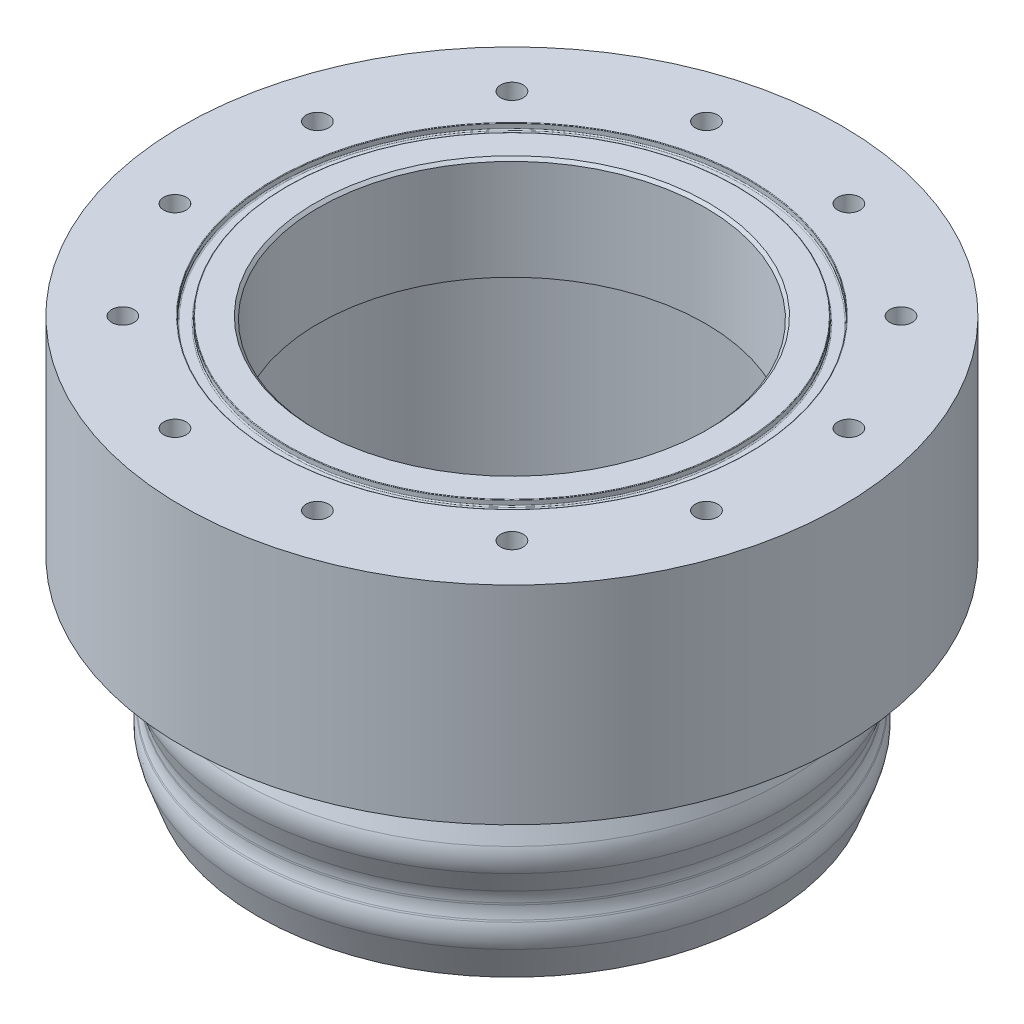
ISO-10303-21;
HEADER;
FILE_DESCRIPTION(('STEP AP214'),'2;1');
FILE_NAME('part.step','',(''),(''),'','','');
FILE_SCHEMA(('AUTOMOTIVE_DESIGN { 1 0 10303 214 1 1 1 1 }'));
ENDSEC;
DATA;
#1=APPLICATION_CONTEXT('core data for automotive mechanical design processes');
#2=APPLICATION_PROTOCOL_DEFINITION('international standard','automotive_design',2000,#1);
#3=PRODUCT_CONTEXT('',#1,'mechanical');
#4=PRODUCT('Part','Part','',(#3));
#5=PRODUCT_RELATED_PRODUCT_CATEGORY('part','',(#4));
#6=PRODUCT_DEFINITION_FORMATION('','',#4);
#7=PRODUCT_DEFINITION_CONTEXT('part definition',#1,'design');
#8=PRODUCT_DEFINITION('design','',#6,#7);
#9=PRODUCT_DEFINITION_SHAPE('','',#8);
#10=(LENGTH_UNIT() NAMED_UNIT(*) SI_UNIT(.MILLI.,.METRE.));
#11=(NAMED_UNIT(*) PLANE_ANGLE_UNIT() SI_UNIT($,.RADIAN.));
#12=(NAMED_UNIT(*) SI_UNIT($,.STERADIAN.) SOLID_ANGLE_UNIT());
#13=UNCERTAINTY_MEASURE_WITH_UNIT(LENGTH_MEASURE(1.E-05),#10,'distance_accuracy_value','');
#14=(GEOMETRIC_REPRESENTATION_CONTEXT(3) GLOBAL_UNCERTAINTY_ASSIGNED_CONTEXT((#13)) GLOBAL_UNIT_ASSIGNED_CONTEXT((#10,
#11,#12)) REPRESENTATION_CONTEXT('',''));
#15=CARTESIAN_POINT('',(0.,0.,0.));
#16=DIRECTION('',(0.,0.,1.));
#17=DIRECTION('',(1.,0.,0.));
#18=AXIS2_PLACEMENT_3D('',#15,#16,#17);
#19=CARTESIAN_POINT('',(0.,0.,0.));
#20=DIRECTION('',(0.,-1.,0.));
#21=DIRECTION('',(0.,0.,-1.));
#22=AXIS2_PLACEMENT_3D('',#19,#20,#21);
#23=CYLINDRICAL_SURFACE('',#22,73.025);
#24=CARTESIAN_POINT('',(0.,-23.15125433516,0.));
#25=DIRECTION('',(0.,-1.,0.));
#26=DIRECTION('',(0.,0.,-1.));
#27=AXIS2_PLACEMENT_3D('',#24,#25,#26);
#28=CIRCLE('',#27,73.025);
#29=CARTESIAN_POINT('',(0.,-23.15125433516,-73.025));
#30=VERTEX_POINT('',#29);
#31=EDGE_CURVE('E115',#30,#30,#28,.T.);
#32=ORIENTED_EDGE('',*,*,#31,.F.);
#33=EDGE_LOOP('',(#32));
#34=FACE_BOUND('',#33,.T.);
#35=CARTESIAN_POINT('',(0.,22.86,0.));
#36=DIRECTION('',(0.,-1.,0.));
#37=DIRECTION('',(0.,0.,-1.));
#38=AXIS2_PLACEMENT_3D('',#35,#36,#37);
#39=CIRCLE('',#38,73.025);
#40=CARTESIAN_POINT('',(0.,22.86,-73.025));
#41=VERTEX_POINT('',#40);
#42=EDGE_CURVE('E162',#41,#41,#39,.T.);
#43=ORIENTED_EDGE('',*,*,#42,.T.);
#44=EDGE_LOOP('',(#43));
#45=FACE_BOUND('',#44,.T.);
#46=ADVANCED_FACE('F40',(#34,#45),#23,.T.);
#47=CARTESIAN_POINT('',(-73.025,-23.15125433516,0.));
#48=DIRECTION('',(0.,1.,0.));
#49=DIRECTION('',(0.,0.,1.));
#50=AXIS2_PLACEMENT_3D('',#47,#48,#49);
#51=PLANE('',#50);
#52=CARTESIAN_POINT('',(0.,-23.15125433516,0.));
#53=DIRECTION('',(0.,1.,0.));
#54=DIRECTION('',(0.,0.,1.));
#55=AXIS2_PLACEMENT_3D('',#52,#53,#54);
#56=CIRCLE('',#55,60.8076);
#57=CARTESIAN_POINT('',(0.,-23.15125433516,60.8076));
#58=VERTEX_POINT('',#57);
#59=EDGE_CURVE('E92',#58,#58,#56,.T.);
#60=ORIENTED_EDGE('',*,*,#59,.T.);
#61=EDGE_LOOP('',(#60));
#62=FACE_BOUND('',#61,.T.);
#63=ORIENTED_EDGE('',*,*,#31,.T.);
#64=EDGE_LOOP('',(#63));
#65=FACE_BOUND('',#64,.T.);
#66=ADVANCED_FACE('F332',(#62,#65),#51,.F.);
#67=CARTESIAN_POINT('',(0.,0.,0.));
#68=DIRECTION('',(0.,-1.,0.));
#69=DIRECTION('',(0.,0.,-1.));
#70=AXIS2_PLACEMENT_3D('',#67,#68,#69);
#71=CYLINDRICAL_SURFACE('',#70,58.2676);
#72=CARTESIAN_POINT('',(0.,-29.1440772325038,0.));
#73=DIRECTION('',(0.,-1.,0.));
#74=DIRECTION('',(0.,0.,-1.));
#75=AXIS2_PLACEMENT_3D('',#72,#73,#74);
#76=CIRCLE('',#75,58.2676);
#77=CARTESIAN_POINT('',(0.,-29.1440772325038,-58.2676));
#78=VERTEX_POINT('',#77);
#79=EDGE_CURVE('E55',#78,#78,#76,.F.);
#80=ORIENTED_EDGE('',*,*,#79,.T.);
#81=EDGE_LOOP('',(#80));
#82=FACE_BOUND('',#81,.T.);
#83=CARTESIAN_POINT('',(0.,-25.69125433516,0.));
#84=DIRECTION('',(0.,1.,0.));
#85=DIRECTION('',(0.,0.,1.));
#86=AXIS2_PLACEMENT_3D('',#83,#84,#85);
#87=CIRCLE('',#86,58.2676);
#88=CARTESIAN_POINT('',(0.,-25.69125433516,58.2676));
#89=VERTEX_POINT('',#88);
#90=EDGE_CURVE('E96',#89,#89,#87,.F.);
#91=ORIENTED_EDGE('',*,*,#90,.T.);
#92=EDGE_LOOP('',(#91));
#93=FACE_BOUND('',#92,.T.);
#94=ADVANCED_FACE('F338',(#82,#93),#71,.T.);
#95=CARTESIAN_POINT('',(0.,-30.4876888255023,0.));
#96=DIRECTION('',(0.,-1.,0.));
#97=DIRECTION('',(0.,0.,-1.));
#98=AXIS2_PLACEMENT_3D('',#95,#96,#97);
#99=CONICAL_SURFACE('',#98,58.2676,0.349065850398867);
#100=CARTESIAN_POINT('',(0.,-31.7502707246454,0.));
#101=DIRECTION('',(0.,-1.,0.));
#102=DIRECTION('',(0.,0.,-1.));
#103=AXIS2_PLACEMENT_3D('',#100,#101,#102);
#104=CIRCLE('',#103,58.7271422296114);
#105=CARTESIAN_POINT('',(0.,-31.7502707246454,-58.7271422296114));
#106=VERTEX_POINT('',#105);
#107=EDGE_CURVE('E62',#106,#106,#104,.T.);
#108=ORIENTED_EDGE('',*,*,#107,.T.);
#109=EDGE_LOOP('',(#108));
#110=FACE_BOUND('',#109,.T.);
#111=CARTESIAN_POINT('',(0.,-36.2558065078584,0.));
#112=DIRECTION('',(0.,1.,0.));
#113=DIRECTION('',(0.,0.,1.));
#114=AXIS2_PLACEMENT_3D('',#111,#112,#113);
#115=CIRCLE('',#114,60.3670231441222);
#116=CARTESIAN_POINT('',(0.,-36.2558065078584,60.3670231441222));
#117=VERTEX_POINT('',#116);
#118=EDGE_CURVE('E107',#117,#117,#115,.T.);
#119=ORIENTED_EDGE('',*,*,#118,.T.);
#120=EDGE_LOOP('',(#119));
#121=FACE_BOUND('',#120,.T.);
#122=ADVANCED_FACE('F379',(#110,#121),#99,.T.);
#123=CARTESIAN_POINT('',(0.,-38.862,0.));
#124=DIRECTION('',(0.,1.,0.));
#125=DIRECTION('',(0.,0.,1.));
#126=AXIS2_PLACEMENT_3D('',#123,#124,#125);
#127=CONICAL_SURFACE('',#126,61.3156,0.349065850398866);
#128=CARTESIAN_POINT('',(0.,-45.9737292753546,0.));
#129=DIRECTION('',(0.,1.,0.));
#130=DIRECTION('',(0.,0.,1.));
#131=AXIS2_PLACEMENT_3D('',#128,#129,#130);
#132=CIRCLE('',#131,58.7271422296114);
#133=CARTESIAN_POINT('',(0.,-45.9737292753546,58.7271422296114));
#134=VERTEX_POINT('',#133);
#135=EDGE_CURVE('E68',#134,#134,#132,.T.);
#136=ORIENTED_EDGE('',*,*,#135,.T.);
#137=EDGE_LOOP('',(#136));
#138=FACE_BOUND('',#137,.T.);
#139=CARTESIAN_POINT('',(0.,-41.4681934921416,0.));
#140=DIRECTION('',(0.,-1.,0.));
#141=DIRECTION('',(0.,0.,-1.));
#142=AXIS2_PLACEMENT_3D('',#139,#140,#141);
#143=CIRCLE('',#142,60.3670231441222);
#144=CARTESIAN_POINT('',(0.,-41.4681934921416,-60.3670231441222));
#145=VERTEX_POINT('',#144);
#146=EDGE_CURVE('E111',#145,#145,#143,.T.);
#147=ORIENTED_EDGE('',*,*,#146,.T.);
#148=EDGE_LOOP('',(#147));
#149=FACE_BOUND('',#148,.T.);
#150=ADVANCED_FACE('F382',(#138,#149),#127,.T.);
#151=CARTESIAN_POINT('',(0.,0.,0.));
#152=DIRECTION('',(0.,-1.,0.));
#153=DIRECTION('',(0.,0.,-1.));
#154=AXIS2_PLACEMENT_3D('',#151,#152,#153);
#155=CYLINDRICAL_SURFACE('',#154,58.2676);
#156=CARTESIAN_POINT('',(0.,-48.9660995814992,0.));
#157=DIRECTION('',(0.,-1.,0.));
#158=DIRECTION('',(0.,0.,-1.));
#159=AXIS2_PLACEMENT_3D('',#156,#157,#158);
#160=CIRCLE('',#159,58.2676);
#161=CARTESIAN_POINT('',(0.,-48.9660995814992,-58.2676));
#162=VERTEX_POINT('',#161);
#163=EDGE_CURVE('E72',#162,#162,#160,.F.);
#164=ORIENTED_EDGE('',*,*,#163,.T.);
#165=EDGE_LOOP('',(#164));
#166=FACE_BOUND('',#165,.T.);
#167=CARTESIAN_POINT('',(0.,-48.5799227674962,0.));
#168=DIRECTION('',(0.,-1.,0.));
#169=DIRECTION('',(0.,0.,-1.));
#170=AXIS2_PLACEMENT_3D('',#167,#168,#169);
#171=CIRCLE('',#170,58.2676);
#172=CARTESIAN_POINT('',(0.,-48.5799227674962,-58.2676));
#173=VERTEX_POINT('',#172);
#174=EDGE_CURVE('E76',#173,#173,#171,.T.);
#175=ORIENTED_EDGE('',*,*,#174,.T.);
#176=EDGE_LOOP('',(#175));
#177=FACE_BOUND('',#176,.T.);
#178=ADVANCED_FACE('F389',(#166,#177),#155,.T.);
#179=CARTESIAN_POINT('',(0.,-50.3097111744977,0.));
#180=DIRECTION('',(0.,-1.,0.));
#181=DIRECTION('',(0.,0.,-1.));
#182=AXIS2_PLACEMENT_3D('',#179,#180,#181);
#183=CONICAL_SURFACE('',#182,58.2676,0.349065850398869);
#184=CARTESIAN_POINT('',(0.,-51.5722930736408,0.));
#185=DIRECTION('',(0.,-1.,0.));
#186=DIRECTION('',(0.,0.,-1.));
#187=AXIS2_PLACEMENT_3D('',#184,#185,#186);
#188=CIRCLE('',#187,58.7271422296114);
#189=CARTESIAN_POINT('',(0.,-51.5722930736408,-58.7271422296114));
#190=VERTEX_POINT('',#189);
#191=EDGE_CURVE('E80',#190,#190,#188,.T.);
#192=ORIENTED_EDGE('',*,*,#191,.T.);
#193=EDGE_LOOP('',(#192));
#194=FACE_BOUND('',#193,.T.);
#195=CARTESIAN_POINT('',(0.,-51.8906732696049,0.));
#196=DIRECTION('',(0.,1.,0.));
#197=DIRECTION('',(0.,0.,1.));
#198=AXIS2_PLACEMENT_3D('',#195,#196,#197);
#199=CIRCLE('',#198,58.8430231441222);
#200=CARTESIAN_POINT('',(0.,-51.8906732696049,58.8430231441222));
#201=VERTEX_POINT('',#200);
#202=EDGE_CURVE('E84',#201,#201,#199,.T.);
#203=ORIENTED_EDGE('',*,*,#202,.T.);
#204=EDGE_LOOP('',(#203));
#205=FACE_BOUND('',#204,.T.);
#206=ADVANCED_FACE('F395',(#194,#205),#183,.T.);
#207=CARTESIAN_POINT('',(0.,-54.4968667617465,0.));
#208=DIRECTION('',(0.,1.,0.));
#209=DIRECTION('',(0.,0.,1.));
#210=AXIS2_PLACEMENT_3D('',#207,#208,#209);
#211=CONICAL_SURFACE('',#210,59.7916,0.349065850398868);
#212=CARTESIAN_POINT('',(0.,-57.1030602538881,0.));
#213=DIRECTION('',(0.,-1.,0.));
#214=DIRECTION('',(0.,0.,-1.));
#215=AXIS2_PLACEMENT_3D('',#212,#213,#214);
#216=CIRCLE('',#215,58.8430231441222);
#217=CARTESIAN_POINT('',(0.,-57.1030602538881,-58.8430231441222));
#218=VERTEX_POINT('',#217);
#219=EDGE_CURVE('E88',#218,#218,#216,.T.);
#220=ORIENTED_EDGE('',*,*,#219,.T.);
#221=EDGE_LOOP('',(#220));
#222=FACE_BOUND('',#221,.T.);
#223=CARTESIAN_POINT('',(0.,-64.2668964653271,0.));
#224=DIRECTION('',(0.,-1.,0.));
#225=DIRECTION('',(0.,0.,-1.));
#226=AXIS2_PLACEMENT_3D('',#223,#224,#225);
#227=CIRCLE('',#226,56.2356);
#228=CARTESIAN_POINT('',(0.,-64.2668964653271,-56.2356));
#229=VERTEX_POINT('',#228);
#230=EDGE_CURVE('E119',#229,#229,#227,.T.);
#231=ORIENTED_EDGE('',*,*,#230,.F.);
#232=EDGE_LOOP('',(#231));
#233=FACE_BOUND('',#232,.T.);
#234=ADVANCED_FACE('F432',(#222,#233),#211,.T.);
#235=CARTESIAN_POINT('',(-56.2356,-64.2668964653271,0.));
#236=DIRECTION('',(0.,1.,0.));
#237=DIRECTION('',(0.,0.,1.));
#238=AXIS2_PLACEMENT_3D('',#235,#236,#237);
#239=PLANE('',#238);
#240=CARTESIAN_POINT('',(0.,-64.2668964653271,0.));
#241=DIRECTION('',(0.,-1.,0.));
#242=DIRECTION('',(0.,0.,-1.));
#243=AXIS2_PLACEMENT_3D('',#240,#241,#242);
#244=CIRCLE('',#243,55.7276);
#245=CARTESIAN_POINT('',(0.,-64.2668964653271,-55.7276));
#246=VERTEX_POINT('',#245);
#247=EDGE_CURVE('E122',#246,#246,#244,.T.);
#248=ORIENTED_EDGE('',*,*,#247,.F.);
#249=EDGE_LOOP('',(#248));
#250=FACE_BOUND('',#249,.T.);
#251=ORIENTED_EDGE('',*,*,#230,.T.);
#252=EDGE_LOOP('',(#251));
#253=FACE_BOUND('',#252,.T.);
#254=ADVANCED_FACE('F768',(#250,#253),#239,.F.);
#255=CARTESIAN_POINT('',(0.,0.,0.));
#256=DIRECTION('',(0.,-1.,0.));
#257=DIRECTION('',(0.,0.,-1.));
#258=AXIS2_PLACEMENT_3D('',#255,#256,#257);
#259=CYLINDRICAL_SURFACE('',#258,55.7276);
#260=CARTESIAN_POINT('',(0.,-2.54,0.));
#261=DIRECTION('',(0.,1.,0.));
#262=DIRECTION('',(0.,0.,1.));
#263=AXIS2_PLACEMENT_3D('',#260,#261,#262);
#264=CIRCLE('',#263,55.7276);
#265=CARTESIAN_POINT('',(0.,-2.54,55.7276));
#266=VERTEX_POINT('',#265);
#267=EDGE_CURVE('E100',#266,#266,#264,.T.);
#268=ORIENTED_EDGE('',*,*,#267,.T.);
#269=EDGE_LOOP('',(#268));
#270=FACE_BOUND('',#269,.T.);
#271=ORIENTED_EDGE('',*,*,#247,.T.);
#272=EDGE_LOOP('',(#271));
#273=FACE_BOUND('',#272,.T.);
#274=ADVANCED_FACE('F778',(#270,#273),#259,.F.);
#275=CARTESIAN_POINT('',(-42.8625,0.,0.));
#276=DIRECTION('',(0.,1.,0.));
#277=DIRECTION('',(0.,0.,1.));
#278=AXIS2_PLACEMENT_3D('',#275,#276,#277);
#279=PLANE('',#278);
#280=CARTESIAN_POINT('',(0.,0.,0.));
#281=DIRECTION('',(0.,1.,0.));
#282=DIRECTION('',(0.,0.,1.));
#283=AXIS2_PLACEMENT_3D('',#280,#281,#282);
#284=CIRCLE('',#283,53.1876);
#285=CARTESIAN_POINT('',(0.,0.,53.1876));
#286=VERTEX_POINT('',#285);
#287=EDGE_CURVE('E104',#286,#286,#284,.F.);
#288=ORIENTED_EDGE('',*,*,#287,.T.);
#289=EDGE_LOOP('',(#288));
#290=FACE_BOUND('',#289,.T.);
#291=CARTESIAN_POINT('',(0.,0.,0.));
#292=DIRECTION('',(0.,-1.,0.));
#293=DIRECTION('',(0.,0.,-1.));
#294=AXIS2_PLACEMENT_3D('',#291,#292,#293);
#295=CIRCLE('',#294,42.8625);
#296=CARTESIAN_POINT('',(0.,0.,-42.8625));
#297=VERTEX_POINT('',#296);
#298=EDGE_CURVE('E126',#297,#297,#295,.T.);
#299=ORIENTED_EDGE('',*,*,#298,.F.);
#300=EDGE_LOOP('',(#299));
#301=FACE_BOUND('',#300,.T.);
#302=ADVANCED_FACE('F329',(#290,#301),#279,.F.);
#303=CARTESIAN_POINT('',(0.,0.,0.));
#304=DIRECTION('',(0.,-1.,0.));
#305=DIRECTION('',(0.,0.,-1.));
#306=AXIS2_PLACEMENT_3D('',#303,#304,#305);
#307=CYLINDRICAL_SURFACE('',#306,42.8625);
#308=CARTESIAN_POINT('',(0.,22.225,0.));
#309=DIRECTION('',(0.,-1.,0.));
#310=DIRECTION('',(0.,0.,-1.));
#311=AXIS2_PLACEMENT_3D('',#308,#309,#310);
#312=CIRCLE('',#311,42.8625);
#313=CARTESIAN_POINT('',(0.,22.225,-42.8625));
#314=VERTEX_POINT('',#313);
#315=EDGE_CURVE('E10',#314,#314,#312,.F.);
#316=ORIENTED_EDGE('',*,*,#315,.T.);
#317=EDGE_LOOP('',(#316));
#318=FACE_BOUND('',#317,.T.);
#319=ORIENTED_EDGE('',*,*,#298,.T.);
#320=EDGE_LOOP('',(#319));
#321=FACE_BOUND('',#320,.T.);
#322=ADVANCED_FACE('F324',(#318,#321),#307,.F.);
#323=CARTESIAN_POINT('',(-42.8625,22.86,0.));
#324=DIRECTION('',(0.,-1.,0.));
#325=DIRECTION('',(0.,0.,-1.));
#326=AXIS2_PLACEMENT_3D('',#323,#324,#325);
#327=PLANE('',#326);
#328=CARTESIAN_POINT('',(0.,22.86,0.));
#329=DIRECTION('',(0.,-1.,0.));
#330=DIRECTION('',(0.,0.,-1.));
#331=AXIS2_PLACEMENT_3D('',#328,#329,#330);
#332=CIRCLE('',#331,43.4975);
#333=CARTESIAN_POINT('',(0.,22.86,-43.4975));
#334=VERTEX_POINT('',#333);
#335=EDGE_CURVE('E48',#334,#334,#332,.T.);
#336=ORIENTED_EDGE('',*,*,#335,.T.);
#337=EDGE_LOOP('',(#336));
#338=FACE_BOUND('',#337,.T.);
#339=CARTESIAN_POINT('',(0.,22.86,0.));
#340=DIRECTION('',(0.,-1.,0.));
#341=DIRECTION('',(0.,0.,-1.));
#342=AXIS2_PLACEMENT_3D('',#339,#340,#341);
#343=CIRCLE('',#342,49.7459);
#344=CARTESIAN_POINT('',(0.,22.86,-49.7459));
#345=VERTEX_POINT('',#344);
#346=EDGE_CURVE('E130',#345,#345,#343,.T.);
#347=ORIENTED_EDGE('',*,*,#346,.F.);
#348=EDGE_LOOP('',(#347));
#349=FACE_BOUND('',#348,.T.);
#350=ADVANCED_FACE('F319',(#338,#349),#327,.F.);
#351=CARTESIAN_POINT('',(0.,22.733,0.));
#352=DIRECTION('',(0.,-1.,0.));
#353=DIRECTION('',(0.,0.,-1.));
#354=AXIS2_PLACEMENT_3D('',#351,#352,#353);
#355=TOROIDAL_SURFACE('',#354,49.7459,0.127);
#356=CARTESIAN_POINT('',(0.,22.733,0.));
#357=DIRECTION('',(0.,-1.,0.));
#358=DIRECTION('',(0.,0.,-1.));
#359=AXIS2_PLACEMENT_3D('',#356,#357,#358);
#360=CIRCLE('',#359,49.8729);
#361=CARTESIAN_POINT('',(0.,22.733,-49.8729));
#362=VERTEX_POINT('',#361);
#363=EDGE_CURVE('E134',#362,#362,#360,.T.);
#364=ORIENTED_EDGE('',*,*,#363,.F.);
#365=EDGE_LOOP('',(#364));
#366=FACE_BOUND('',#365,.T.);
#367=ORIENTED_EDGE('',*,*,#346,.T.);
#368=EDGE_LOOP('',(#367));
#369=FACE_BOUND('',#368,.T.);
#370=ADVANCED_FACE('F313',(#366,#369),#355,.T.);
#371=CARTESIAN_POINT('',(0.,0.,0.));
#372=DIRECTION('',(0.,-1.,0.));
#373=DIRECTION('',(0.,0.,-1.));
#374=AXIS2_PLACEMENT_3D('',#371,#372,#373);
#375=CYLINDRICAL_SURFACE('',#374,49.8729);
#376=CARTESIAN_POINT('',(0.,21.7932,0.));
#377=DIRECTION('',(0.,-1.,0.));
#378=DIRECTION('',(0.,0.,-1.));
#379=AXIS2_PLACEMENT_3D('',#376,#377,#378);
#380=CIRCLE('',#379,49.8729);
#381=CARTESIAN_POINT('',(0.,21.7932,-49.8729));
#382=VERTEX_POINT('',#381);
#383=EDGE_CURVE('E138',#382,#382,#380,.T.);
#384=ORIENTED_EDGE('',*,*,#383,.F.);
#385=EDGE_LOOP('',(#384));
#386=FACE_BOUND('',#385,.T.);
#387=ORIENTED_EDGE('',*,*,#363,.T.);
#388=EDGE_LOOP('',(#387));
#389=FACE_BOUND('',#388,.T.);
#390=ADVANCED_FACE('F307',(#386,#389),#375,.T.);
#391=CARTESIAN_POINT('',(0.,21.7932,0.));
#392=DIRECTION('',(0.,-1.,0.));
#393=DIRECTION('',(0.,0.,-1.));
#394=AXIS2_PLACEMENT_3D('',#391,#392,#393);
#395=TOROIDAL_SURFACE('',#394,50.1269,0.253999999999999);
#396=CARTESIAN_POINT('',(0.,21.5392,0.));
#397=DIRECTION('',(0.,-1.,0.));
#398=DIRECTION('',(0.,0.,-1.));
#399=AXIS2_PLACEMENT_3D('',#396,#397,#398);
#400=CIRCLE('',#399,50.1269);
#401=CARTESIAN_POINT('',(0.,21.5392,-50.1269));
#402=VERTEX_POINT('',#401);
#403=EDGE_CURVE('E142',#402,#402,#400,.T.);
#404=ORIENTED_EDGE('',*,*,#403,.F.);
#405=EDGE_LOOP('',(#404));
#406=FACE_BOUND('',#405,.T.);
#407=ORIENTED_EDGE('',*,*,#383,.T.);
#408=EDGE_LOOP('',(#407));
#409=FACE_BOUND('',#408,.T.);
#410=ADVANCED_FACE('F301',(#406,#409),#395,.F.);
#411=CARTESIAN_POINT('',(-52.1843,21.5392,0.));
#412=DIRECTION('',(0.,-1.,0.));
#413=DIRECTION('',(0.,0.,-1.));
#414=AXIS2_PLACEMENT_3D('',#411,#412,#413);
#415=PLANE('',#414);
#416=CARTESIAN_POINT('',(0.,21.5392,0.));
#417=DIRECTION('',(0.,-1.,0.));
#418=DIRECTION('',(0.,0.,-1.));
#419=AXIS2_PLACEMENT_3D('',#416,#417,#418);
#420=CIRCLE('',#419,52.1843);
#421=CARTESIAN_POINT('',(0.,21.5392,-52.1843));
#422=VERTEX_POINT('',#421);
#423=EDGE_CURVE('E146',#422,#422,#420,.T.);
#424=ORIENTED_EDGE('',*,*,#423,.F.);
#425=EDGE_LOOP('',(#424));
#426=FACE_BOUND('',#425,.T.);
#427=ORIENTED_EDGE('',*,*,#403,.T.);
#428=EDGE_LOOP('',(#427));
#429=FACE_BOUND('',#428,.T.);
#430=ADVANCED_FACE('F295',(#426,#429),#415,.F.);
#431=CARTESIAN_POINT('',(0.,21.7932,0.));
#432=DIRECTION('',(0.,-1.,0.));
#433=DIRECTION('',(0.,0.,-1.));
#434=AXIS2_PLACEMENT_3D('',#431,#432,#433);
#435=TOROIDAL_SURFACE('',#434,52.1843,0.253999999999999);
#436=CARTESIAN_POINT('',(0.,21.7932,0.));
#437=DIRECTION('',(0.,-1.,0.));
#438=DIRECTION('',(0.,0.,-1.));
#439=AXIS2_PLACEMENT_3D('',#436,#437,#438);
#440=CIRCLE('',#439,52.4383);
#441=CARTESIAN_POINT('',(0.,21.7932,-52.4383));
#442=VERTEX_POINT('',#441);
#443=EDGE_CURVE('E150',#442,#442,#440,.T.);
#444=ORIENTED_EDGE('',*,*,#443,.F.);
#445=EDGE_LOOP('',(#444));
#446=FACE_BOUND('',#445,.T.);
#447=ORIENTED_EDGE('',*,*,#423,.T.);
#448=EDGE_LOOP('',(#447));
#449=FACE_BOUND('',#448,.T.);
#450=ADVANCED_FACE('F289',(#446,#449),#435,.F.);
#451=CARTESIAN_POINT('',(0.,0.,0.));
#452=DIRECTION('',(0.,-1.,0.));
#453=DIRECTION('',(0.,0.,-1.));
#454=AXIS2_PLACEMENT_3D('',#451,#452,#453);
#455=CYLINDRICAL_SURFACE('',#454,52.4383);
#456=CARTESIAN_POINT('',(0.,22.733,0.));
#457=DIRECTION('',(0.,-1.,0.));
#458=DIRECTION('',(0.,0.,-1.));
#459=AXIS2_PLACEMENT_3D('',#456,#457,#458);
#460=CIRCLE('',#459,52.4383);
#461=CARTESIAN_POINT('',(0.,22.733,-52.4383));
#462=VERTEX_POINT('',#461);
#463=EDGE_CURVE('E154',#462,#462,#460,.T.);
#464=ORIENTED_EDGE('',*,*,#463,.F.);
#465=EDGE_LOOP('',(#464));
#466=FACE_BOUND('',#465,.T.);
#467=ORIENTED_EDGE('',*,*,#443,.T.);
#468=EDGE_LOOP('',(#467));
#469=FACE_BOUND('',#468,.T.);
#470=ADVANCED_FACE('F283',(#466,#469),#455,.F.);
#471=CARTESIAN_POINT('',(0.,22.733,0.));
#472=DIRECTION('',(0.,-1.,0.));
#473=DIRECTION('',(0.,0.,-1.));
#474=AXIS2_PLACEMENT_3D('',#471,#472,#473);
#475=TOROIDAL_SURFACE('',#474,52.5653,0.127);
#476=CARTESIAN_POINT('',(0.,22.86,0.));
#477=DIRECTION('',(0.,-1.,0.));
#478=DIRECTION('',(0.,0.,-1.));
#479=AXIS2_PLACEMENT_3D('',#476,#477,#478);
#480=CIRCLE('',#479,52.5653);
#481=CARTESIAN_POINT('',(0.,22.86,-52.5653));
#482=VERTEX_POINT('',#481);
#483=EDGE_CURVE('E158',#482,#482,#480,.T.);
#484=ORIENTED_EDGE('',*,*,#483,.F.);
#485=EDGE_LOOP('',(#484));
#486=FACE_BOUND('',#485,.T.);
#487=ORIENTED_EDGE('',*,*,#463,.T.);
#488=EDGE_LOOP('',(#487));
#489=FACE_BOUND('',#488,.T.);
#490=ADVANCED_FACE('F253',(#486,#489),#475,.T.);
#491=CARTESIAN_POINT('',(-73.025,22.86,0.));
#492=DIRECTION('',(0.,-1.,0.));
#493=DIRECTION('',(0.,0.,-1.));
#494=AXIS2_PLACEMENT_3D('',#491,#492,#493);
#495=PLANE('',#494);
#496=CARTESIAN_POINT('',(-58.8828383705818,22.86,15.7776089894489));
#497=DIRECTION('',(0.,1.,0.));
#498=DIRECTION('',(0.499999999999989,0.,0.866025403784445));
#499=AXIS2_PLACEMENT_3D('',#496,#497,#498);
#500=CIRCLE('',#499,2.4892);
#501=CARTESIAN_POINT('',(-57.6382383705818,22.86,17.9333194245491));
#502=VERTEX_POINT('',#501);
#503=EDGE_CURVE('E234',#502,#502,#500,.T.);
#504=ORIENTED_EDGE('',*,*,#503,.F.);
#505=EDGE_LOOP('',(#504));
#506=FACE_BOUND('',#505,.T.);
#507=CARTESIAN_POINT('',(-43.1052293811325,22.86,43.1052293811314));
#508=DIRECTION('',(0.,1.,0.));
#509=DIRECTION('',(0.866025403784433,0.,0.50000000000001));
#510=AXIS2_PLACEMENT_3D('',#507,#508,#509);
#511=CIRCLE('',#510,2.4892);
#512=CARTESIAN_POINT('',(-40.9495189460323,22.86,44.3498293811314));
#513=VERTEX_POINT('',#512);
#514=EDGE_CURVE('E228',#513,#513,#511,.T.);
#515=ORIENTED_EDGE('',*,*,#514,.F.);
#516=EDGE_LOOP('',(#515));
#517=FACE_BOUND('',#516,.T.);
#518=CARTESIAN_POINT('',(-15.7776089894503,22.86,58.8828383705814));
#519=DIRECTION('',(0.,1.,0.));
#520=DIRECTION('',(1.,0.,0.));
#521=AXIS2_PLACEMENT_3D('',#518,#519,#520);
#522=CIRCLE('',#521,2.4892);
#523=CARTESIAN_POINT('',(-13.2884089894503,22.86,58.8828383705815));
#524=VERTEX_POINT('',#523);
#525=EDGE_CURVE('E222',#524,#524,#522,.T.);
#526=ORIENTED_EDGE('',*,*,#525,.F.);
#527=EDGE_LOOP('',(#526));
#528=FACE_BOUND('',#527,.T.);
#529=CARTESIAN_POINT('',(15.7776089894491,22.86,58.8828383705818));
#530=DIRECTION('',(0.,1.,0.));
#531=DIRECTION('',(0.866025403784443,0.,-0.499999999999992));
#532=AXIS2_PLACEMENT_3D('',#529,#530,#531);
#533=CIRCLE('',#532,2.4892);
#534=CARTESIAN_POINT('',(17.9333194245493,22.86,57.6382383705818));
#535=VERTEX_POINT('',#534);
#536=EDGE_CURVE('E216',#535,#535,#533,.T.);
#537=ORIENTED_EDGE('',*,*,#536,.F.);
#538=EDGE_LOOP('',(#537));
#539=FACE_BOUND('',#538,.T.);
#540=CARTESIAN_POINT('',(43.1052293811316,22.86,43.1052293811323));
#541=DIRECTION('',(0.,1.,0.));
#542=DIRECTION('',(0.500000000000007,0.,-0.866025403784435));
#543=AXIS2_PLACEMENT_3D('',#540,#541,#542);
#544=CIRCLE('',#543,2.4892);
#545=CARTESIAN_POINT('',(44.3498293811316,22.86,40.9495189460321));
#546=VERTEX_POINT('',#545);
#547=EDGE_CURVE('E210',#546,#546,#544,.T.);
#548=ORIENTED_EDGE('',*,*,#547,.F.);
#549=EDGE_LOOP('',(#548));
#550=FACE_BOUND('',#549,.T.);
#551=CARTESIAN_POINT('',(58.8828383705815,22.86,15.7776089894501));
#552=DIRECTION('',(0.,1.,0.));
#553=DIRECTION('',(0.,0.,-1.));
#554=AXIS2_PLACEMENT_3D('',#551,#552,#553);
#555=CIRCLE('',#554,2.4892);
#556=CARTESIAN_POINT('',(58.8828383705815,22.86,13.2884089894501));
#557=VERTEX_POINT('',#556);
#558=EDGE_CURVE('E204',#557,#557,#555,.T.);
#559=ORIENTED_EDGE('',*,*,#558,.F.);
#560=EDGE_LOOP('',(#559));
#561=FACE_BOUND('',#560,.T.);
#562=CARTESIAN_POINT('',(58.8828383705817,22.86,-15.7776089894493));
#563=DIRECTION('',(0.,1.,0.));
#564=DIRECTION('',(-0.499999999999995,0.,-0.866025403784442));
#565=AXIS2_PLACEMENT_3D('',#562,#563,#564);
#566=CIRCLE('',#565,2.4892);
#567=CARTESIAN_POINT('',(57.6382383705817,22.86,-17.9333194245495));
#568=VERTEX_POINT('',#567);
#569=EDGE_CURVE('E198',#568,#568,#566,.T.);
#570=ORIENTED_EDGE('',*,*,#569,.F.);
#571=EDGE_LOOP('',(#570));
#572=FACE_BOUND('',#571,.T.);
#573=CARTESIAN_POINT('',(43.1052293811322,22.86,-43.1052293811317));
#574=DIRECTION('',(0.,1.,0.));
#575=DIRECTION('',(-0.866025403784436,0.,-0.500000000000004));
#576=AXIS2_PLACEMENT_3D('',#573,#574,#575);
#577=CIRCLE('',#576,2.4892);
#578=CARTESIAN_POINT('',(40.949518946032,22.86,-44.3498293811317));
#579=VERTEX_POINT('',#578);
#580=EDGE_CURVE('E191',#579,#579,#577,.T.);
#581=ORIENTED_EDGE('',*,*,#580,.F.);
#582=EDGE_LOOP('',(#581));
#583=FACE_BOUND('',#582,.T.);
#584=CARTESIAN_POINT('',(15.7776089894499,22.86,-58.8828383705815));
#585=DIRECTION('',(0.,1.,0.));
#586=DIRECTION('',(-1.,0.,0.));
#587=AXIS2_PLACEMENT_3D('',#584,#585,#586);
#588=CIRCLE('',#587,2.4892);
#589=CARTESIAN_POINT('',(13.2884089894499,22.86,-58.8828383705815));
#590=VERTEX_POINT('',#589);
#591=EDGE_CURVE('E185',#590,#590,#588,.T.);
#592=ORIENTED_EDGE('',*,*,#591,.F.);
#593=EDGE_LOOP('',(#592));
#594=FACE_BOUND('',#593,.T.);
#595=CARTESIAN_POINT('',(-15.7776089894495,22.86,-58.8828383705817));
#596=DIRECTION('',(0.,1.,0.));
#597=DIRECTION('',(-0.86602540378444,0.,0.499999999999998));
#598=AXIS2_PLACEMENT_3D('',#595,#596,#597);
#599=CIRCLE('',#598,2.4892);
#600=CARTESIAN_POINT('',(-17.9333194245497,22.86,-57.6382383705817));
#601=VERTEX_POINT('',#600);
#602=EDGE_CURVE('E179',#601,#601,#599,.T.);
#603=ORIENTED_EDGE('',*,*,#602,.F.);
#604=EDGE_LOOP('',(#603));
#605=FACE_BOUND('',#604,.T.);
#606=CARTESIAN_POINT('',(-43.1052293811319,22.86,-43.105229381132));
#607=DIRECTION('',(0.,1.,0.));
#608=DIRECTION('',(-0.500000000000001,0.,0.866025403784438));
#609=AXIS2_PLACEMENT_3D('',#606,#607,#608);
#610=CIRCLE('',#609,2.4892);
#611=CARTESIAN_POINT('',(-44.3498293811319,22.86,-40.9495189460318));
#612=VERTEX_POINT('',#611);
#613=EDGE_CURVE('E173',#612,#612,#610,.T.);
#614=ORIENTED_EDGE('',*,*,#613,.F.);
#615=EDGE_LOOP('',(#614));
#616=FACE_BOUND('',#615,.T.);
#617=CARTESIAN_POINT('',(-58.8828383705816,22.86,-15.7776089894497));
#618=DIRECTION('',(0.,1.,0.));
#619=DIRECTION('',(0.,0.,1.));
#620=AXIS2_PLACEMENT_3D('',#617,#618,#619);
#621=CIRCLE('',#620,2.4892);
#622=CARTESIAN_POINT('',(-58.8828383705816,22.86,-13.2884089894497));
#623=VERTEX_POINT('',#622);
#624=EDGE_CURVE('E167',#623,#623,#621,.T.);
#625=ORIENTED_EDGE('',*,*,#624,.F.);
#626=EDGE_LOOP('',(#625));
#627=FACE_BOUND('',#626,.T.);
#628=ORIENTED_EDGE('',*,*,#42,.F.);
#629=EDGE_LOOP('',(#628));
#630=FACE_BOUND('',#629,.T.);
#631=ORIENTED_EDGE('',*,*,#483,.T.);
#632=EDGE_LOOP('',(#631));
#633=FACE_BOUND('',#632,.T.);
#634=ADVANCED_FACE('F249',(#506,#517,#528,#539,#550,#561,#572,#583,#594,#605,#616,#627,#630,
#633),#495,.F.);
#635=CARTESIAN_POINT('',(-58.8828383705816,1.26999999999999,-15.7776089894497));
#636=DIRECTION('',(0.,1.,0.));
#637=DIRECTION('',(0.,0.,1.));
#638=AXIS2_PLACEMENT_3D('',#635,#636,#637);
#639=CYLINDRICAL_SURFACE('',#638,2.4892);
#640=CARTESIAN_POINT('',(-58.8828383705816,1.26999999999999,-15.7776089894497));
#641=DIRECTION('',(0.,1.,0.));
#642=DIRECTION('',(0.,0.,1.));
#643=AXIS2_PLACEMENT_3D('',#640,#641,#642);
#644=CIRCLE('',#643,2.4892);
#645=CARTESIAN_POINT('',(-58.8828383705816,1.26999999999999,-13.2884089894497));
#646=VERTEX_POINT('',#645);
#647=EDGE_CURVE('E166',#646,#646,#644,.T.);
#648=ORIENTED_EDGE('',*,*,#647,.F.);
#649=EDGE_LOOP('',(#648));
#650=FACE_BOUND('',#649,.T.);
#651=ORIENTED_EDGE('',*,*,#624,.T.);
#652=EDGE_LOOP('',(#651));
#653=FACE_BOUND('',#652,.T.);
#654=ADVANCED_FACE('F252',(#650,#653),#639,.F.);
#655=CARTESIAN_POINT('',(-58.8828383705816,1.26999999999999,-15.7776089894497));
#656=DIRECTION('',(0.,1.,0.));
#657=DIRECTION('',(0.,0.,1.));
#658=AXIS2_PLACEMENT_3D('',#655,#656,#657);
#659=PLANE('',#658);
#660=ORIENTED_EDGE('',*,*,#647,.T.);
#661=EDGE_LOOP('',(#660));
#662=FACE_BOUND('',#661,.T.);
#663=ADVANCED_FACE('F523',(#662),#659,.T.);
#664=CARTESIAN_POINT('',(-43.1052293811319,1.26999999999999,-43.105229381132));
#665=DIRECTION('',(0.,1.,0.));
#666=DIRECTION('',(0.,0.,1.));
#667=AXIS2_PLACEMENT_3D('',#664,#665,#666);
#668=CYLINDRICAL_SURFACE('',#667,2.4892);
#669=CARTESIAN_POINT('',(-43.1052293811319,1.26999999999999,-43.105229381132));
#670=DIRECTION('',(0.,1.,0.));
#671=DIRECTION('',(-0.500000000000001,0.,0.866025403784438));
#672=AXIS2_PLACEMENT_3D('',#669,#670,#671);
#673=CIRCLE('',#672,2.4892);
#674=CARTESIAN_POINT('',(-44.3498293811319,1.26999999999999,-40.9495189460318));
#675=VERTEX_POINT('',#674);
#676=EDGE_CURVE('E170',#675,#675,#673,.T.);
#677=ORIENTED_EDGE('',*,*,#676,.F.);
#678=EDGE_LOOP('',(#677));
#679=FACE_BOUND('',#678,.T.);
#680=ORIENTED_EDGE('',*,*,#613,.T.);
#681=EDGE_LOOP('',(#680));
#682=FACE_BOUND('',#681,.T.);
#683=ADVANCED_FACE('F531',(#679,#682),#668,.F.);
#684=CARTESIAN_POINT('',(-43.1052293811319,1.26999999999999,-43.105229381132));
#685=DIRECTION('',(0.,1.,0.));
#686=DIRECTION('',(-0.500000000000001,0.,0.866025403784438));
#687=AXIS2_PLACEMENT_3D('',#684,#685,#686);
#688=PLANE('',#687);
#689=ORIENTED_EDGE('',*,*,#676,.T.);
#690=EDGE_LOOP('',(#689));
#691=FACE_BOUND('',#690,.T.);
#692=ADVANCED_FACE('F539',(#691),#688,.T.);
#693=CARTESIAN_POINT('',(-15.7776089894495,1.26999999999999,-58.8828383705817));
#694=DIRECTION('',(0.,1.,0.));
#695=DIRECTION('',(0.,0.,1.));
#696=AXIS2_PLACEMENT_3D('',#693,#694,#695);
#697=CYLINDRICAL_SURFACE('',#696,2.4892);
#698=CARTESIAN_POINT('',(-15.7776089894495,1.26999999999999,-58.8828383705817));
#699=DIRECTION('',(0.,1.,0.));
#700=DIRECTION('',(-0.86602540378444,0.,0.499999999999998));
#701=AXIS2_PLACEMENT_3D('',#698,#699,#700);
#702=CIRCLE('',#701,2.4892);
#703=CARTESIAN_POINT('',(-17.9333194245497,1.26999999999999,-57.6382383705817));
#704=VERTEX_POINT('',#703);
#705=EDGE_CURVE('E176',#704,#704,#702,.T.);
#706=ORIENTED_EDGE('',*,*,#705,.F.);
#707=EDGE_LOOP('',(#706));
#708=FACE_BOUND('',#707,.T.);
#709=ORIENTED_EDGE('',*,*,#602,.T.);
#710=EDGE_LOOP('',(#709));
#711=FACE_BOUND('',#710,.T.);
#712=ADVANCED_FACE('F549',(#708,#711),#697,.F.);
#713=CARTESIAN_POINT('',(-15.7776089894495,1.26999999999999,-58.8828383705817));
#714=DIRECTION('',(0.,1.,0.));
#715=DIRECTION('',(-0.86602540378444,0.,0.499999999999998));
#716=AXIS2_PLACEMENT_3D('',#713,#714,#715);
#717=PLANE('',#716);
#718=ORIENTED_EDGE('',*,*,#705,.T.);
#719=EDGE_LOOP('',(#718));
#720=FACE_BOUND('',#719,.T.);
#721=ADVANCED_FACE('F559',(#720),#717,.T.);
#722=CARTESIAN_POINT('',(15.7776089894499,1.26999999999999,-58.8828383705815));
#723=DIRECTION('',(0.,1.,0.));
#724=DIRECTION('',(0.,0.,1.));
#725=AXIS2_PLACEMENT_3D('',#722,#723,#724);
#726=CYLINDRICAL_SURFACE('',#725,2.4892);
#727=CARTESIAN_POINT('',(15.7776089894499,1.26999999999999,-58.8828383705815));
#728=DIRECTION('',(0.,1.,0.));
#729=DIRECTION('',(-1.,0.,0.));
#730=AXIS2_PLACEMENT_3D('',#727,#728,#729);
#731=CIRCLE('',#730,2.4892);
#732=CARTESIAN_POINT('',(13.2884089894499,1.26999999999999,-58.8828383705815));
#733=VERTEX_POINT('',#732);
#734=EDGE_CURVE('E182',#733,#733,#731,.T.);
#735=ORIENTED_EDGE('',*,*,#734,.F.);
#736=EDGE_LOOP('',(#735));
#737=FACE_BOUND('',#736,.T.);
#738=ORIENTED_EDGE('',*,*,#591,.T.);
#739=EDGE_LOOP('',(#738));
#740=FACE_BOUND('',#739,.T.);
#741=ADVANCED_FACE('F569',(#737,#740),#726,.F.);
#742=CARTESIAN_POINT('',(15.7776089894499,1.26999999999999,-58.8828383705815));
#743=DIRECTION('',(0.,1.,0.));
#744=DIRECTION('',(-1.,0.,0.));
#745=AXIS2_PLACEMENT_3D('',#742,#743,#744);
#746=PLANE('',#745);
#747=ORIENTED_EDGE('',*,*,#734,.T.);
#748=EDGE_LOOP('',(#747));
#749=FACE_BOUND('',#748,.T.);
#750=ADVANCED_FACE('F579',(#749),#746,.T.);
#751=CARTESIAN_POINT('',(43.1052293811322,1.26999999999999,-43.1052293811317));
#752=DIRECTION('',(0.,1.,0.));
#753=DIRECTION('',(0.,0.,1.));
#754=AXIS2_PLACEMENT_3D('',#751,#752,#753);
#755=CYLINDRICAL_SURFACE('',#754,2.4892);
#756=CARTESIAN_POINT('',(43.1052293811322,1.26999999999999,-43.1052293811317));
#757=DIRECTION('',(0.,1.,0.));
#758=DIRECTION('',(-0.866025403784436,0.,-0.500000000000004));
#759=AXIS2_PLACEMENT_3D('',#756,#757,#758);
#760=CIRCLE('',#759,2.4892);
#761=CARTESIAN_POINT('',(40.949518946032,1.26999999999999,-44.3498293811317));
#762=VERTEX_POINT('',#761);
#763=EDGE_CURVE('E188',#762,#762,#760,.T.);
#764=ORIENTED_EDGE('',*,*,#763,.F.);
#765=EDGE_LOOP('',(#764));
#766=FACE_BOUND('',#765,.T.);
#767=ORIENTED_EDGE('',*,*,#580,.T.);
#768=EDGE_LOOP('',(#767));
#769=FACE_BOUND('',#768,.T.);
#770=ADVANCED_FACE('F589',(#766,#769),#755,.F.);
#771=CARTESIAN_POINT('',(43.1052293811322,1.26999999999999,-43.1052293811317));
#772=DIRECTION('',(0.,1.,0.));
#773=DIRECTION('',(-0.866025403784436,0.,-0.500000000000004));
#774=AXIS2_PLACEMENT_3D('',#771,#772,#773);
#775=PLANE('',#774);
#776=ORIENTED_EDGE('',*,*,#763,.T.);
#777=EDGE_LOOP('',(#776));
#778=FACE_BOUND('',#777,.T.);
#779=ADVANCED_FACE('F599',(#778),#775,.T.);
#780=CARTESIAN_POINT('',(58.8828383705817,1.26999999999999,-15.7776089894493));
#781=DIRECTION('',(0.,1.,0.));
#782=DIRECTION('',(0.,0.,1.));
#783=AXIS2_PLACEMENT_3D('',#780,#781,#782);
#784=CYLINDRICAL_SURFACE('',#783,2.4892);
#785=CARTESIAN_POINT('',(58.8828383705817,1.26999999999999,-15.7776089894493));
#786=DIRECTION('',(0.,1.,0.));
#787=DIRECTION('',(-0.499999999999995,0.,-0.866025403784442));
#788=AXIS2_PLACEMENT_3D('',#785,#786,#787);
#789=CIRCLE('',#788,2.4892);
#790=CARTESIAN_POINT('',(57.6382383705817,1.26999999999999,-17.9333194245495));
#791=VERTEX_POINT('',#790);
#792=EDGE_CURVE('E195',#791,#791,#789,.T.);
#793=ORIENTED_EDGE('',*,*,#792,.F.);
#794=EDGE_LOOP('',(#793));
#795=FACE_BOUND('',#794,.T.);
#796=ORIENTED_EDGE('',*,*,#569,.T.);
#797=EDGE_LOOP('',(#796));
#798=FACE_BOUND('',#797,.T.);
#799=ADVANCED_FACE('F609',(#795,#798),#784,.F.);
#800=CARTESIAN_POINT('',(58.8828383705817,1.26999999999999,-15.7776089894493));
#801=DIRECTION('',(0.,1.,0.));
#802=DIRECTION('',(-0.499999999999995,0.,-0.866025403784442));
#803=AXIS2_PLACEMENT_3D('',#800,#801,#802);
#804=PLANE('',#803);
#805=ORIENTED_EDGE('',*,*,#792,.T.);
#806=EDGE_LOOP('',(#805));
#807=FACE_BOUND('',#806,.T.);
#808=ADVANCED_FACE('F619',(#807),#804,.T.);
#809=CARTESIAN_POINT('',(58.8828383705815,1.26999999999999,15.7776089894501));
#810=DIRECTION('',(0.,1.,0.));
#811=DIRECTION('',(0.,0.,1.));
#812=AXIS2_PLACEMENT_3D('',#809,#810,#811);
#813=CYLINDRICAL_SURFACE('',#812,2.4892);
#814=CARTESIAN_POINT('',(58.8828383705815,1.26999999999999,15.7776089894501));
#815=DIRECTION('',(0.,1.,0.));
#816=DIRECTION('',(0.,0.,-1.));
#817=AXIS2_PLACEMENT_3D('',#814,#815,#816);
#818=CIRCLE('',#817,2.4892);
#819=CARTESIAN_POINT('',(58.8828383705815,1.26999999999999,13.2884089894501));
#820=VERTEX_POINT('',#819);
#821=EDGE_CURVE('E201',#820,#820,#818,.T.);
#822=ORIENTED_EDGE('',*,*,#821,.F.);
#823=EDGE_LOOP('',(#822));
#824=FACE_BOUND('',#823,.T.);
#825=ORIENTED_EDGE('',*,*,#558,.T.);
#826=EDGE_LOOP('',(#825));
#827=FACE_BOUND('',#826,.T.);
#828=ADVANCED_FACE('F629',(#824,#827),#813,.F.);
#829=CARTESIAN_POINT('',(58.8828383705815,1.26999999999999,15.7776089894501));
#830=DIRECTION('',(0.,1.,0.));
#831=DIRECTION('',(0.,0.,-1.));
#832=AXIS2_PLACEMENT_3D('',#829,#830,#831);
#833=PLANE('',#832);
#834=ORIENTED_EDGE('',*,*,#821,.T.);
#835=EDGE_LOOP('',(#834));
#836=FACE_BOUND('',#835,.T.);
#837=ADVANCED_FACE('F639',(#836),#833,.T.);
#838=CARTESIAN_POINT('',(43.1052293811316,1.26999999999999,43.1052293811323));
#839=DIRECTION('',(0.,1.,0.));
#840=DIRECTION('',(0.,0.,1.));
#841=AXIS2_PLACEMENT_3D('',#838,#839,#840);
#842=CYLINDRICAL_SURFACE('',#841,2.4892);
#843=CARTESIAN_POINT('',(43.1052293811316,1.26999999999999,43.1052293811323));
#844=DIRECTION('',(0.,1.,0.));
#845=DIRECTION('',(0.500000000000007,0.,-0.866025403784435));
#846=AXIS2_PLACEMENT_3D('',#843,#844,#845);
#847=CIRCLE('',#846,2.4892);
#848=CARTESIAN_POINT('',(44.3498293811316,1.26999999999999,40.9495189460321));
#849=VERTEX_POINT('',#848);
#850=EDGE_CURVE('E207',#849,#849,#847,.T.);
#851=ORIENTED_EDGE('',*,*,#850,.F.);
#852=EDGE_LOOP('',(#851));
#853=FACE_BOUND('',#852,.T.);
#854=ORIENTED_EDGE('',*,*,#547,.T.);
#855=EDGE_LOOP('',(#854));
#856=FACE_BOUND('',#855,.T.);
#857=ADVANCED_FACE('F649',(#853,#856),#842,.F.);
#858=CARTESIAN_POINT('',(43.1052293811316,1.26999999999999,43.1052293811323));
#859=DIRECTION('',(0.,1.,0.));
#860=DIRECTION('',(0.500000000000007,0.,-0.866025403784435));
#861=AXIS2_PLACEMENT_3D('',#858,#859,#860);
#862=PLANE('',#861);
#863=ORIENTED_EDGE('',*,*,#850,.T.);
#864=EDGE_LOOP('',(#863));
#865=FACE_BOUND('',#864,.T.);
#866=ADVANCED_FACE('F659',(#865),#862,.T.);
#867=CARTESIAN_POINT('',(15.7776089894491,1.26999999999999,58.8828383705818));
#868=DIRECTION('',(0.,1.,0.));
#869=DIRECTION('',(0.,0.,1.));
#870=AXIS2_PLACEMENT_3D('',#867,#868,#869);
#871=CYLINDRICAL_SURFACE('',#870,2.4892);
#872=CARTESIAN_POINT('',(15.7776089894491,1.26999999999999,58.8828383705818));
#873=DIRECTION('',(0.,1.,0.));
#874=DIRECTION('',(0.866025403784443,0.,-0.499999999999992));
#875=AXIS2_PLACEMENT_3D('',#872,#873,#874);
#876=CIRCLE('',#875,2.4892);
#877=CARTESIAN_POINT('',(17.9333194245493,1.26999999999999,57.6382383705818));
#878=VERTEX_POINT('',#877);
#879=EDGE_CURVE('E213',#878,#878,#876,.T.);
#880=ORIENTED_EDGE('',*,*,#879,.F.);
#881=EDGE_LOOP('',(#880));
#882=FACE_BOUND('',#881,.T.);
#883=ORIENTED_EDGE('',*,*,#536,.T.);
#884=EDGE_LOOP('',(#883));
#885=FACE_BOUND('',#884,.T.);
#886=ADVANCED_FACE('F669',(#882,#885),#871,.F.);
#887=CARTESIAN_POINT('',(15.7776089894491,1.26999999999999,58.8828383705818));
#888=DIRECTION('',(0.,1.,0.));
#889=DIRECTION('',(0.866025403784443,0.,-0.499999999999992));
#890=AXIS2_PLACEMENT_3D('',#887,#888,#889);
#891=PLANE('',#890);
#892=ORIENTED_EDGE('',*,*,#879,.T.);
#893=EDGE_LOOP('',(#892));
#894=FACE_BOUND('',#893,.T.);
#895=ADVANCED_FACE('F679',(#894),#891,.T.);
#896=CARTESIAN_POINT('',(-15.7776089894503,1.26999999999999,58.8828383705814));
#897=DIRECTION('',(0.,1.,0.));
#898=DIRECTION('',(0.,0.,1.));
#899=AXIS2_PLACEMENT_3D('',#896,#897,#898);
#900=CYLINDRICAL_SURFACE('',#899,2.4892);
#901=CARTESIAN_POINT('',(-15.7776089894503,1.26999999999999,58.8828383705814));
#902=DIRECTION('',(0.,1.,0.));
#903=DIRECTION('',(1.,0.,0.));
#904=AXIS2_PLACEMENT_3D('',#901,#902,#903);
#905=CIRCLE('',#904,2.4892);
#906=CARTESIAN_POINT('',(-13.2884089894503,1.26999999999999,58.8828383705815));
#907=VERTEX_POINT('',#906);
#908=EDGE_CURVE('E219',#907,#907,#905,.T.);
#909=ORIENTED_EDGE('',*,*,#908,.F.);
#910=EDGE_LOOP('',(#909));
#911=FACE_BOUND('',#910,.T.);
#912=ORIENTED_EDGE('',*,*,#525,.T.);
#913=EDGE_LOOP('',(#912));
#914=FACE_BOUND('',#913,.T.);
#915=ADVANCED_FACE('F689',(#911,#914),#900,.F.);
#916=CARTESIAN_POINT('',(-15.7776089894503,1.26999999999999,58.8828383705814));
#917=DIRECTION('',(0.,1.,0.));
#918=DIRECTION('',(1.,0.,0.));
#919=AXIS2_PLACEMENT_3D('',#916,#917,#918);
#920=PLANE('',#919);
#921=ORIENTED_EDGE('',*,*,#908,.T.);
#922=EDGE_LOOP('',(#921));
#923=FACE_BOUND('',#922,.T.);
#924=ADVANCED_FACE('F699',(#923),#920,.T.);
#925=CARTESIAN_POINT('',(-43.1052293811325,1.26999999999999,43.1052293811314));
#926=DIRECTION('',(0.,1.,0.));
#927=DIRECTION('',(0.,0.,1.));
#928=AXIS2_PLACEMENT_3D('',#925,#926,#927);
#929=CYLINDRICAL_SURFACE('',#928,2.4892);
#930=CARTESIAN_POINT('',(-43.1052293811325,1.26999999999999,43.1052293811314));
#931=DIRECTION('',(0.,1.,0.));
#932=DIRECTION('',(0.866025403784433,0.,0.50000000000001));
#933=AXIS2_PLACEMENT_3D('',#930,#931,#932);
#934=CIRCLE('',#933,2.4892);
#935=CARTESIAN_POINT('',(-40.9495189460323,1.26999999999999,44.3498293811314));
#936=VERTEX_POINT('',#935);
#937=EDGE_CURVE('E225',#936,#936,#934,.T.);
#938=ORIENTED_EDGE('',*,*,#937,.F.);
#939=EDGE_LOOP('',(#938));
#940=FACE_BOUND('',#939,.T.);
#941=ORIENTED_EDGE('',*,*,#514,.T.);
#942=EDGE_LOOP('',(#941));
#943=FACE_BOUND('',#942,.T.);
#944=ADVANCED_FACE('F709',(#940,#943),#929,.F.);
#945=CARTESIAN_POINT('',(-43.1052293811325,1.26999999999999,43.1052293811314));
#946=DIRECTION('',(0.,1.,0.));
#947=DIRECTION('',(0.866025403784433,0.,0.50000000000001));
#948=AXIS2_PLACEMENT_3D('',#945,#946,#947);
#949=PLANE('',#948);
#950=ORIENTED_EDGE('',*,*,#937,.T.);
#951=EDGE_LOOP('',(#950));
#952=FACE_BOUND('',#951,.T.);
#953=ADVANCED_FACE('F245',(#952),#949,.T.);
#954=CARTESIAN_POINT('',(-58.8828383705818,1.26999999999999,15.7776089894489));
#955=DIRECTION('',(0.,1.,0.));
#956=DIRECTION('',(0.,0.,1.));
#957=AXIS2_PLACEMENT_3D('',#954,#955,#956);
#958=CYLINDRICAL_SURFACE('',#957,2.4892);
#959=CARTESIAN_POINT('',(-58.8828383705818,1.26999999999999,15.7776089894489));
#960=DIRECTION('',(0.,1.,0.));
#961=DIRECTION('',(0.499999999999989,0.,0.866025403784445));
#962=AXIS2_PLACEMENT_3D('',#959,#960,#961);
#963=CIRCLE('',#962,2.4892);
#964=CARTESIAN_POINT('',(-57.6382383705818,1.26999999999999,17.9333194245491));
#965=VERTEX_POINT('',#964);
#966=EDGE_CURVE('E231',#965,#965,#963,.T.);
#967=ORIENTED_EDGE('',*,*,#966,.F.);
#968=EDGE_LOOP('',(#967));
#969=FACE_BOUND('',#968,.T.);
#970=ORIENTED_EDGE('',*,*,#503,.T.);
#971=EDGE_LOOP('',(#970));
#972=FACE_BOUND('',#971,.T.);
#973=ADVANCED_FACE('F242',(#969,#972),#958,.F.);
#974=CARTESIAN_POINT('',(-58.8828383705818,1.26999999999999,15.7776089894489));
#975=DIRECTION('',(0.,1.,0.));
#976=DIRECTION('',(0.499999999999989,0.,0.866025403784445));
#977=AXIS2_PLACEMENT_3D('',#974,#975,#976);
#978=PLANE('',#977);
#979=ORIENTED_EDGE('',*,*,#966,.T.);
#980=EDGE_LOOP('',(#979));
#981=FACE_BOUND('',#980,.T.);
#982=ADVANCED_FACE('F240',(#981),#978,.T.);
#983=CARTESIAN_POINT('',(0.,-38.862,0.));
#984=DIRECTION('',(0.,1.,0.));
#985=DIRECTION('',(0.,0.,1.));
#986=AXIS2_PLACEMENT_3D('',#983,#984,#985);
#987=TOROIDAL_SURFACE('',#986,53.2065653737335,7.62);
#988=ORIENTED_EDGE('',*,*,#118,.F.);
#989=EDGE_LOOP('',(#988));
#990=FACE_BOUND('',#989,.T.);
#991=ORIENTED_EDGE('',*,*,#146,.F.);
#992=EDGE_LOOP('',(#991));
#993=FACE_BOUND('',#992,.T.);
#994=ADVANCED_FACE('F345',(#990,#993),#987,.T.);
#995=CARTESIAN_POINT('',(0.,-2.54,0.));
#996=DIRECTION('',(0.,1.,0.));
#997=DIRECTION('',(0.,0.,1.));
#998=AXIS2_PLACEMENT_3D('',#995,#996,#997);
#999=TOROIDAL_SURFACE('',#998,53.1876,2.54);
#1000=ORIENTED_EDGE('',*,*,#267,.F.);
#1001=EDGE_LOOP('',(#1000));
#1002=FACE_BOUND('',#1001,.T.);
#1003=ORIENTED_EDGE('',*,*,#287,.F.);
#1004=EDGE_LOOP('',(#1003));
#1005=FACE_BOUND('',#1004,.T.);
#1006=ADVANCED_FACE('F348',(#1002,#1005),#999,.F.);
#1007=CARTESIAN_POINT('',(0.,-25.69125433516,0.));
#1008=DIRECTION('',(0.,1.,0.));
#1009=DIRECTION('',(0.,0.,1.));
#1010=AXIS2_PLACEMENT_3D('',#1007,#1008,#1009);
#1011=TOROIDAL_SURFACE('',#1010,60.8076,2.54);
#1012=ORIENTED_EDGE('',*,*,#59,.F.);
#1013=EDGE_LOOP('',(#1012));
#1014=FACE_BOUND('',#1013,.T.);
#1015=ORIENTED_EDGE('',*,*,#90,.F.);
#1016=EDGE_LOOP('',(#1015));
#1017=FACE_BOUND('',#1016,.T.);
#1018=ADVANCED_FACE('F352',(#1014,#1017),#1011,.F.);
#1019=CARTESIAN_POINT('',(0.,-54.4968667617465,0.));
#1020=DIRECTION('',(0.,1.,0.));
#1021=DIRECTION('',(0.,0.,1.));
#1022=AXIS2_PLACEMENT_3D('',#1019,#1020,#1021);
#1023=TOROIDAL_SURFACE('',#1022,51.6825653737335,7.62);
#1024=ORIENTED_EDGE('',*,*,#202,.F.);
#1025=EDGE_LOOP('',(#1024));
#1026=FACE_BOUND('',#1025,.T.);
#1027=ORIENTED_EDGE('',*,*,#219,.F.);
#1028=EDGE_LOOP('',(#1027));
#1029=FACE_BOUND('',#1028,.T.);
#1030=ADVANCED_FACE('F356',(#1026,#1029),#1023,.T.);
#1031=CARTESIAN_POINT('',(0.,-48.9660995814992,0.));
#1032=DIRECTION('',(0.,-1.,0.));
#1033=DIRECTION('',(0.,0.,-1.));
#1034=AXIS2_PLACEMENT_3D('',#1031,#1032,#1033);
#1035=TOROIDAL_SURFACE('',#1034,65.8876,7.62);
#1036=ORIENTED_EDGE('',*,*,#163,.F.);
#1037=EDGE_LOOP('',(#1036));
#1038=FACE_BOUND('',#1037,.T.);
#1039=ORIENTED_EDGE('',*,*,#191,.F.);
#1040=EDGE_LOOP('',(#1039));
#1041=FACE_BOUND('',#1040,.T.);
#1042=ADVANCED_FACE('F360',(#1038,#1041),#1035,.F.);
#1043=CARTESIAN_POINT('',(0.,-48.5799227674962,0.));
#1044=DIRECTION('',(0.,-1.,0.));
#1045=DIRECTION('',(0.,0.,-1.));
#1046=AXIS2_PLACEMENT_3D('',#1043,#1044,#1045);
#1047=TOROIDAL_SURFACE('',#1046,65.8876,7.62);
#1048=ORIENTED_EDGE('',*,*,#135,.F.);
#1049=EDGE_LOOP('',(#1048));
#1050=FACE_BOUND('',#1049,.T.);
#1051=ORIENTED_EDGE('',*,*,#174,.F.);
#1052=EDGE_LOOP('',(#1051));
#1053=FACE_BOUND('',#1052,.T.);
#1054=ADVANCED_FACE('F364',(#1050,#1053),#1047,.F.);
#1055=CARTESIAN_POINT('',(0.,-29.1440772325038,0.));
#1056=DIRECTION('',(0.,-1.,0.));
#1057=DIRECTION('',(0.,0.,-1.));
#1058=AXIS2_PLACEMENT_3D('',#1055,#1056,#1057);
#1059=TOROIDAL_SURFACE('',#1058,65.8876,7.62);
#1060=ORIENTED_EDGE('',*,*,#79,.F.);
#1061=EDGE_LOOP('',(#1060));
#1062=FACE_BOUND('',#1061,.T.);
#1063=ORIENTED_EDGE('',*,*,#107,.F.);
#1064=EDGE_LOOP('',(#1063));
#1065=FACE_BOUND('',#1064,.T.);
#1066=ADVANCED_FACE('F367',(#1062,#1065),#1059,.F.);
#1067=CARTESIAN_POINT('',(0.,22.86,0.));
#1068=DIRECTION('',(0.,1.,0.));
#1069=DIRECTION('',(0.,0.,1.));
#1070=AXIS2_PLACEMENT_3D('',#1067,#1068,#1069);
#1071=CONICAL_SURFACE('',#1070,43.4975,0.785398163397454);
#1072=ORIENTED_EDGE('',*,*,#315,.F.);
#1073=EDGE_LOOP('',(#1072));
#1074=FACE_BOUND('',#1073,.T.);
#1075=ORIENTED_EDGE('',*,*,#335,.F.);
#1076=EDGE_LOOP('',(#1075));
#1077=FACE_BOUND('',#1076,.T.);
#1078=ADVANCED_FACE('F42',(#1074,#1077),#1071,.F.);
#1079=CLOSED_SHELL('',(#46,#66,#94,#122,#150,#178,#206,#234,#254,#274,#302,#322,#350,#370,#390,
#410,#430,#450,#470,#490,#634,#654,#663,#683,#692,#712,#721,#741,#750,#770,#779,#799,#808,#828,
#837,#857,#866,#886,#895,#915,#924,#944,#953,#973,#982,#994,#1006,#1018,#1030,#1042,#1054,#1066,#1078));
#1080=MANIFOLD_SOLID_BREP('B2',#1079);
#1081=ADVANCED_BREP_SHAPE_REPRESENTATION('',(#18,#1080),#14);
#1082=SHAPE_DEFINITION_REPRESENTATION(#9,#1081);
ENDSEC;
END-ISO-10303-21;
